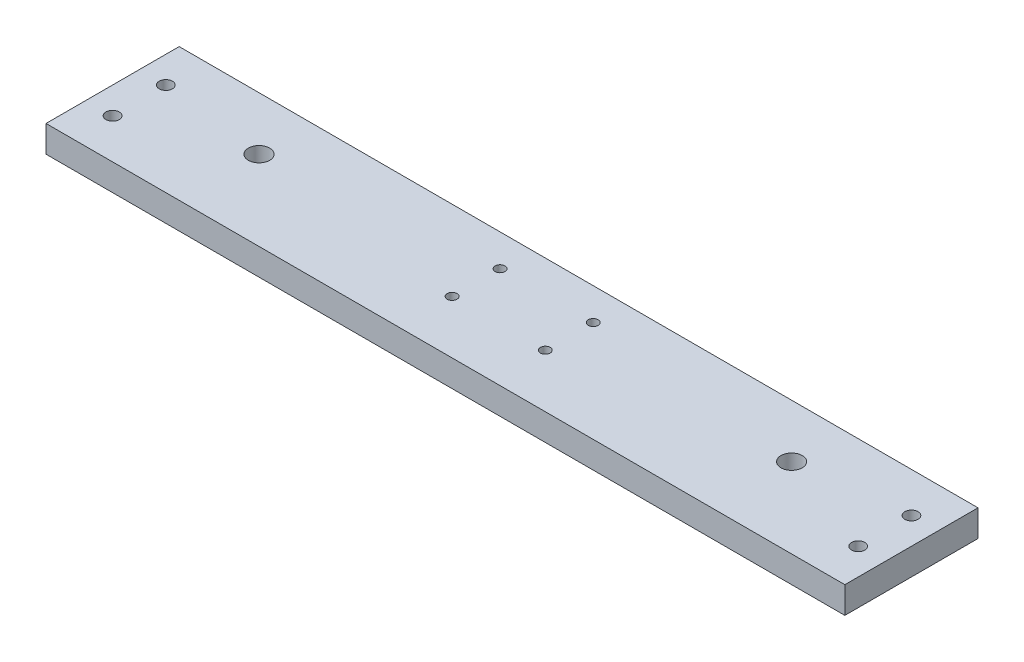
ISO-10303-21;
HEADER;
FILE_DESCRIPTION(('STEP AP214'),'2;1');
FILE_NAME('part.step','',(''),(''),'','','');
FILE_SCHEMA(('AUTOMOTIVE_DESIGN { 1 0 10303 214 1 1 1 1 }'));
ENDSEC;
DATA;
#1=APPLICATION_CONTEXT('core data for automotive mechanical design processes');
#2=APPLICATION_PROTOCOL_DEFINITION('international standard','automotive_design',2000,#1);
#3=PRODUCT_CONTEXT('',#1,'mechanical');
#4=PRODUCT('Part','Part','',(#3));
#5=PRODUCT_RELATED_PRODUCT_CATEGORY('part','',(#4));
#6=PRODUCT_DEFINITION_FORMATION('','',#4);
#7=PRODUCT_DEFINITION_CONTEXT('part definition',#1,'design');
#8=PRODUCT_DEFINITION('design','',#6,#7);
#9=PRODUCT_DEFINITION_SHAPE('','',#8);
#10=(LENGTH_UNIT() NAMED_UNIT(*) SI_UNIT(.MILLI.,.METRE.));
#11=(NAMED_UNIT(*) PLANE_ANGLE_UNIT() SI_UNIT($,.RADIAN.));
#12=(NAMED_UNIT(*) SI_UNIT($,.STERADIAN.) SOLID_ANGLE_UNIT());
#13=UNCERTAINTY_MEASURE_WITH_UNIT(LENGTH_MEASURE(1.E-05),#10,'distance_accuracy_value','');
#14=(GEOMETRIC_REPRESENTATION_CONTEXT(3) GLOBAL_UNCERTAINTY_ASSIGNED_CONTEXT((#13)) GLOBAL_UNIT_ASSIGNED_CONTEXT((#10,
#11,#12)) REPRESENTATION_CONTEXT('',''));
#15=CARTESIAN_POINT('',(0.,0.,0.));
#16=DIRECTION('',(0.,0.,1.));
#17=DIRECTION('',(1.,0.,0.));
#18=AXIS2_PLACEMENT_3D('',#15,#16,#17);
#19=CARTESIAN_POINT('',(0.,10.,0.));
#20=DIRECTION('',(0.,1.,0.));
#21=DIRECTION('',(0.,0.,1.));
#22=AXIS2_PLACEMENT_3D('',#19,#20,#21);
#23=PLANE('',#22);
#24=CARTESIAN_POINT('',(17.5,10.,-8.00000000000001));
#25=DIRECTION('',(0.,1.,0.));
#26=DIRECTION('',(0.,0.,-1.));
#27=AXIS2_PLACEMENT_3D('',#24,#25,#26);
#28=CIRCLE('',#27,1.85);
#29=CARTESIAN_POINT('',(17.5,10.,-9.85000000000001));
#30=VERTEX_POINT('',#29);
#31=EDGE_CURVE('E162',#30,#30,#28,.T.);
#32=ORIENTED_EDGE('',*,*,#31,.F.);
#33=EDGE_LOOP('',(#32));
#34=FACE_BOUND('',#33,.T.);
#35=CARTESIAN_POINT('',(-17.5,10.,10.));
#36=DIRECTION('',(0.,1.,0.));
#37=DIRECTION('',(0.,0.,-1.));
#38=AXIS2_PLACEMENT_3D('',#35,#36,#37);
#39=CIRCLE('',#38,1.85);
#40=CARTESIAN_POINT('',(-17.5,10.,8.15));
#41=VERTEX_POINT('',#40);
#42=EDGE_CURVE('E155',#41,#41,#39,.T.);
#43=ORIENTED_EDGE('',*,*,#42,.F.);
#44=EDGE_LOOP('',(#43));
#45=FACE_BOUND('',#44,.T.);
#46=CARTESIAN_POINT('',(17.5,10.,10.));
#47=DIRECTION('',(0.,1.,0.));
#48=DIRECTION('',(0.,0.,1.));
#49=AXIS2_PLACEMENT_3D('',#46,#47,#48);
#50=CIRCLE('',#49,1.85);
#51=CARTESIAN_POINT('',(17.5,10.,11.85));
#52=VERTEX_POINT('',#51);
#53=EDGE_CURVE('E167',#52,#52,#50,.T.);
#54=ORIENTED_EDGE('',*,*,#53,.F.);
#55=EDGE_LOOP('',(#54));
#56=FACE_BOUND('',#55,.T.);
#57=CARTESIAN_POINT('',(-17.5,10.,-8.));
#58=DIRECTION('',(0.,1.,0.));
#59=DIRECTION('',(0.,0.,1.));
#60=AXIS2_PLACEMENT_3D('',#57,#58,#59);
#61=CIRCLE('',#60,1.85);
#62=CARTESIAN_POINT('',(-17.5,10.,-6.15));
#63=VERTEX_POINT('',#62);
#64=EDGE_CURVE('E149',#63,#63,#61,.T.);
#65=ORIENTED_EDGE('',*,*,#64,.F.);
#66=EDGE_LOOP('',(#65));
#67=FACE_BOUND('',#66,.T.);
#68=CARTESIAN_POINT('',(140.,10.,-5.));
#69=DIRECTION('',(0.,1.,0.));
#70=DIRECTION('',(0.,0.,-1.));
#71=AXIS2_PLACEMENT_3D('',#68,#69,#70);
#72=CIRCLE('',#71,2.5);
#73=CARTESIAN_POINT('',(140.,10.,-7.49999999999999));
#74=VERTEX_POINT('',#73);
#75=EDGE_CURVE('E131',#74,#74,#72,.T.);
#76=ORIENTED_EDGE('',*,*,#75,.F.);
#77=EDGE_LOOP('',(#76));
#78=FACE_BOUND('',#77,.T.);
#79=CARTESIAN_POINT('',(140.,10.,15.));
#80=DIRECTION('',(0.,1.,0.));
#81=DIRECTION('',(0.,0.,1.));
#82=AXIS2_PLACEMENT_3D('',#79,#80,#81);
#83=CIRCLE('',#82,2.5);
#84=CARTESIAN_POINT('',(140.,10.,17.5));
#85=VERTEX_POINT('',#84);
#86=EDGE_CURVE('E138',#85,#85,#83,.T.);
#87=ORIENTED_EDGE('',*,*,#86,.F.);
#88=EDGE_LOOP('',(#87));
#89=FACE_BOUND('',#88,.T.);
#90=CARTESIAN_POINT('',(-140.,10.,15.));
#91=DIRECTION('',(0.,1.,0.));
#92=DIRECTION('',(0.,0.,-1.));
#93=AXIS2_PLACEMENT_3D('',#90,#91,#92);
#94=CIRCLE('',#93,2.5);
#95=CARTESIAN_POINT('',(-140.,10.,12.5));
#96=VERTEX_POINT('',#95);
#97=EDGE_CURVE('E144',#96,#96,#94,.T.);
#98=ORIENTED_EDGE('',*,*,#97,.F.);
#99=EDGE_LOOP('',(#98));
#100=FACE_BOUND('',#99,.T.);
#101=CARTESIAN_POINT('',(-140.,10.,-4.99999999999996));
#102=DIRECTION('',(0.,1.,0.));
#103=DIRECTION('',(0.,0.,1.));
#104=AXIS2_PLACEMENT_3D('',#101,#102,#103);
#105=CIRCLE('',#104,2.5);
#106=CARTESIAN_POINT('',(-140.,10.,-2.49999999999997));
#107=VERTEX_POINT('',#106);
#108=EDGE_CURVE('E125',#107,#107,#105,.T.);
#109=ORIENTED_EDGE('',*,*,#108,.F.);
#110=EDGE_LOOP('',(#109));
#111=FACE_BOUND('',#110,.T.);
#112=CARTESIAN_POINT('',(-100.,10.,0.));
#113=DIRECTION('',(0.,1.,0.));
#114=DIRECTION('',(0.,0.,1.));
#115=AXIS2_PLACEMENT_3D('',#112,#113,#114);
#116=CIRCLE('',#115,4.00000000000001);
#117=CARTESIAN_POINT('',(-100.,10.,4.00000000000002));
#118=VERTEX_POINT('',#117);
#119=EDGE_CURVE('E101',#118,#118,#116,.T.);
#120=ORIENTED_EDGE('',*,*,#119,.F.);
#121=EDGE_LOOP('',(#120));
#122=FACE_BOUND('',#121,.T.);
#123=DIRECTION('',(0.,0.,1.));
#124=VECTOR('',#123,1.);
#125=CARTESIAN_POINT('',(-150.,10.,30.));
#126=LINE('',#125,#124);
#127=CARTESIAN_POINT('',(-150.,10.,-20.));
#128=VERTEX_POINT('',#127);
#129=CARTESIAN_POINT('',(-150.,10.,30.));
#130=VERTEX_POINT('',#129);
#131=EDGE_CURVE('E86',#128,#130,#126,.T.);
#132=ORIENTED_EDGE('',*,*,#131,.T.);
#133=DIRECTION('',(1.,0.,0.));
#134=VECTOR('',#133,1.);
#135=CARTESIAN_POINT('',(150.,10.,30.));
#136=LINE('',#135,#134);
#137=CARTESIAN_POINT('',(150.,10.,30.));
#138=VERTEX_POINT('',#137);
#139=EDGE_CURVE('E81',#130,#138,#136,.T.);
#140=ORIENTED_EDGE('',*,*,#139,.T.);
#141=DIRECTION('',(0.,0.,-1.));
#142=VECTOR('',#141,1.);
#143=CARTESIAN_POINT('',(150.,10.,30.));
#144=LINE('',#143,#142);
#145=CARTESIAN_POINT('',(150.,10.,-20.));
#146=VERTEX_POINT('',#145);
#147=EDGE_CURVE('E84',#138,#146,#144,.T.);
#148=ORIENTED_EDGE('',*,*,#147,.T.);
#149=DIRECTION('',(-1.,0.,0.));
#150=VECTOR('',#149,1.);
#151=CARTESIAN_POINT('',(150.,10.,-20.));
#152=LINE('',#151,#150);
#153=EDGE_CURVE('E51',#146,#128,#152,.T.);
#154=ORIENTED_EDGE('',*,*,#153,.T.);
#155=EDGE_LOOP('',(#132,#140,#148,#154));
#156=FACE_BOUND('',#155,.T.);
#157=CARTESIAN_POINT('',(100.,10.,0.));
#158=DIRECTION('',(0.,1.,0.));
#159=DIRECTION('',(0.,0.,-1.));
#160=AXIS2_PLACEMENT_3D('',#157,#158,#159);
#161=CIRCLE('',#160,3.99999999999999);
#162=CARTESIAN_POINT('',(100.,10.,-4.));
#163=VERTEX_POINT('',#162);
#164=EDGE_CURVE('E116',#163,#163,#161,.T.);
#165=ORIENTED_EDGE('',*,*,#164,.F.);
#166=EDGE_LOOP('',(#165));
#167=FACE_BOUND('',#166,.T.);
#168=ADVANCED_FACE('F34',(#34,#45,#56,#67,#78,#89,#100,#111,#122,#156,#167),#23,.T.);
#169=CARTESIAN_POINT('',(0.,0.,0.));
#170=DIRECTION('',(0.,1.,0.));
#171=DIRECTION('',(0.,0.,1.));
#172=AXIS2_PLACEMENT_3D('',#169,#170,#171);
#173=PLANE('',#172);
#174=CARTESIAN_POINT('',(17.5,0.,-8.00000000000001));
#175=DIRECTION('',(0.,1.,0.));
#176=DIRECTION('',(0.,0.,-1.));
#177=AXIS2_PLACEMENT_3D('',#174,#175,#176);
#178=CIRCLE('',#177,1.85);
#179=CARTESIAN_POINT('',(17.5,0.,-9.85000000000001));
#180=VERTEX_POINT('',#179);
#181=EDGE_CURVE('E152',#180,#180,#178,.T.);
#182=ORIENTED_EDGE('',*,*,#181,.T.);
#183=EDGE_LOOP('',(#182));
#184=FACE_BOUND('',#183,.T.);
#185=CARTESIAN_POINT('',(-17.5,0.,10.));
#186=DIRECTION('',(0.,1.,0.));
#187=DIRECTION('',(0.,0.,-1.));
#188=AXIS2_PLACEMENT_3D('',#185,#186,#187);
#189=CIRCLE('',#188,1.85);
#190=CARTESIAN_POINT('',(-17.5,0.,8.15));
#191=VERTEX_POINT('',#190);
#192=EDGE_CURVE('E158',#191,#191,#189,.T.);
#193=ORIENTED_EDGE('',*,*,#192,.T.);
#194=EDGE_LOOP('',(#193));
#195=FACE_BOUND('',#194,.T.);
#196=CARTESIAN_POINT('',(17.5,0.,10.));
#197=DIRECTION('',(0.,1.,0.));
#198=DIRECTION('',(0.,0.,1.));
#199=AXIS2_PLACEMENT_3D('',#196,#197,#198);
#200=CIRCLE('',#199,1.85);
#201=CARTESIAN_POINT('',(17.5,0.,11.85));
#202=VERTEX_POINT('',#201);
#203=EDGE_CURVE('E159',#202,#202,#200,.T.);
#204=ORIENTED_EDGE('',*,*,#203,.T.);
#205=EDGE_LOOP('',(#204));
#206=FACE_BOUND('',#205,.T.);
#207=CARTESIAN_POINT('',(-17.5,0.,-8.));
#208=DIRECTION('',(0.,1.,0.));
#209=DIRECTION('',(0.,0.,1.));
#210=AXIS2_PLACEMENT_3D('',#207,#208,#209);
#211=CIRCLE('',#210,1.85);
#212=CARTESIAN_POINT('',(-17.5,0.,-6.15));
#213=VERTEX_POINT('',#212);
#214=EDGE_CURVE('E135',#213,#213,#211,.T.);
#215=ORIENTED_EDGE('',*,*,#214,.T.);
#216=EDGE_LOOP('',(#215));
#217=FACE_BOUND('',#216,.T.);
#218=CARTESIAN_POINT('',(140.,0.,-5.));
#219=DIRECTION('',(0.,1.,0.));
#220=DIRECTION('',(0.,0.,-1.));
#221=AXIS2_PLACEMENT_3D('',#218,#219,#220);
#222=CIRCLE('',#221,2.5);
#223=CARTESIAN_POINT('',(140.,0.,-7.49999999999999));
#224=VERTEX_POINT('',#223);
#225=EDGE_CURVE('E134',#224,#224,#222,.T.);
#226=ORIENTED_EDGE('',*,*,#225,.T.);
#227=EDGE_LOOP('',(#226));
#228=FACE_BOUND('',#227,.T.);
#229=CARTESIAN_POINT('',(140.,0.,15.));
#230=DIRECTION('',(0.,1.,0.));
#231=DIRECTION('',(0.,0.,1.));
#232=AXIS2_PLACEMENT_3D('',#229,#230,#231);
#233=CIRCLE('',#232,2.5);
#234=CARTESIAN_POINT('',(140.,0.,17.5));
#235=VERTEX_POINT('',#234);
#236=EDGE_CURVE('E141',#235,#235,#233,.T.);
#237=ORIENTED_EDGE('',*,*,#236,.T.);
#238=EDGE_LOOP('',(#237));
#239=FACE_BOUND('',#238,.T.);
#240=CARTESIAN_POINT('',(-140.,0.,15.));
#241=DIRECTION('',(0.,1.,0.));
#242=DIRECTION('',(0.,0.,-1.));
#243=AXIS2_PLACEMENT_3D('',#240,#241,#242);
#244=CIRCLE('',#243,2.5);
#245=CARTESIAN_POINT('',(-140.,0.,12.5));
#246=VERTEX_POINT('',#245);
#247=EDGE_CURVE('E128',#246,#246,#244,.T.);
#248=ORIENTED_EDGE('',*,*,#247,.T.);
#249=EDGE_LOOP('',(#248));
#250=FACE_BOUND('',#249,.T.);
#251=CARTESIAN_POINT('',(-140.,0.,-4.99999999999996));
#252=DIRECTION('',(0.,1.,0.));
#253=DIRECTION('',(0.,0.,1.));
#254=AXIS2_PLACEMENT_3D('',#251,#252,#253);
#255=CIRCLE('',#254,2.5);
#256=CARTESIAN_POINT('',(-140.,0.,-2.49999999999997));
#257=VERTEX_POINT('',#256);
#258=EDGE_CURVE('E122',#257,#257,#255,.T.);
#259=ORIENTED_EDGE('',*,*,#258,.T.);
#260=EDGE_LOOP('',(#259));
#261=FACE_BOUND('',#260,.T.);
#262=DIRECTION('',(0.,0.,1.));
#263=VECTOR('',#262,1.);
#264=CARTESIAN_POINT('',(-150.,0.,30.));
#265=LINE('',#264,#263);
#266=CARTESIAN_POINT('',(-150.,0.,-20.));
#267=VERTEX_POINT('',#266);
#268=CARTESIAN_POINT('',(-150.,0.,30.));
#269=VERTEX_POINT('',#268);
#270=EDGE_CURVE('E98',#267,#269,#265,.T.);
#271=ORIENTED_EDGE('',*,*,#270,.F.);
#272=DIRECTION('',(-1.,0.,0.));
#273=VECTOR('',#272,1.);
#274=CARTESIAN_POINT('',(150.,0.,-20.));
#275=LINE('',#274,#273);
#276=CARTESIAN_POINT('',(150.,0.,-20.));
#277=VERTEX_POINT('',#276);
#278=EDGE_CURVE('E74',#277,#267,#275,.T.);
#279=ORIENTED_EDGE('',*,*,#278,.F.);
#280=DIRECTION('',(0.,0.,-1.));
#281=VECTOR('',#280,1.);
#282=CARTESIAN_POINT('',(150.,0.,30.));
#283=LINE('',#282,#281);
#284=CARTESIAN_POINT('',(150.,0.,30.));
#285=VERTEX_POINT('',#284);
#286=EDGE_CURVE('E68',#285,#277,#283,.T.);
#287=ORIENTED_EDGE('',*,*,#286,.F.);
#288=DIRECTION('',(1.,0.,0.));
#289=VECTOR('',#288,1.);
#290=CARTESIAN_POINT('',(150.,0.,30.));
#291=LINE('',#290,#289);
#292=EDGE_CURVE('E90',#269,#285,#291,.T.);
#293=ORIENTED_EDGE('',*,*,#292,.F.);
#294=EDGE_LOOP('',(#271,#279,#287,#293));
#295=FACE_BOUND('',#294,.T.);
#296=CARTESIAN_POINT('',(-100.,0.,0.));
#297=DIRECTION('',(0.,1.,0.));
#298=DIRECTION('',(0.,0.,1.));
#299=AXIS2_PLACEMENT_3D('',#296,#297,#298);
#300=CIRCLE('',#299,4.00000000000001);
#301=CARTESIAN_POINT('',(-100.,0.,4.00000000000002));
#302=VERTEX_POINT('',#301);
#303=EDGE_CURVE('E113',#302,#302,#300,.T.);
#304=ORIENTED_EDGE('',*,*,#303,.T.);
#305=EDGE_LOOP('',(#304));
#306=FACE_BOUND('',#305,.T.);
#307=CARTESIAN_POINT('',(100.,0.,0.));
#308=DIRECTION('',(0.,1.,0.));
#309=DIRECTION('',(0.,0.,-1.));
#310=AXIS2_PLACEMENT_3D('',#307,#308,#309);
#311=CIRCLE('',#310,3.99999999999999);
#312=CARTESIAN_POINT('',(100.,0.,-4.));
#313=VERTEX_POINT('',#312);
#314=EDGE_CURVE('E119',#313,#313,#311,.T.);
#315=ORIENTED_EDGE('',*,*,#314,.T.);
#316=EDGE_LOOP('',(#315));
#317=FACE_BOUND('',#316,.T.);
#318=ADVANCED_FACE('F109',(#184,#195,#206,#217,#228,#239,#250,#261,#295,#306,#317),#173,.F.);
#319=CARTESIAN_POINT('',(-150.,10.,30.));
#320=DIRECTION('',(1.,0.,0.));
#321=DIRECTION('',(0.,0.,-1.));
#322=AXIS2_PLACEMENT_3D('',#319,#320,#321);
#323=PLANE('',#322);
#324=ORIENTED_EDGE('',*,*,#270,.T.);
#325=DIRECTION('',(0.,-1.,0.));
#326=VECTOR('',#325,1.);
#327=CARTESIAN_POINT('',(-150.,10.,30.));
#328=LINE('',#327,#326);
#329=EDGE_CURVE('E11',#130,#269,#328,.T.);
#330=ORIENTED_EDGE('',*,*,#329,.F.);
#331=ORIENTED_EDGE('',*,*,#131,.F.);
#332=DIRECTION('',(0.,-1.,0.));
#333=VECTOR('',#332,1.);
#334=CARTESIAN_POINT('',(-150.,10.,-20.));
#335=LINE('',#334,#333);
#336=EDGE_CURVE('E94',#128,#267,#335,.T.);
#337=ORIENTED_EDGE('',*,*,#336,.T.);
#338=EDGE_LOOP('',(#324,#330,#331,#337));
#339=FACE_BOUND('',#338,.T.);
#340=ADVANCED_FACE('F36',(#339),#323,.F.);
#341=CARTESIAN_POINT('',(150.,10.,30.));
#342=DIRECTION('',(0.,0.,-1.));
#343=DIRECTION('',(-1.,0.,0.));
#344=AXIS2_PLACEMENT_3D('',#341,#342,#343);
#345=PLANE('',#344);
#346=ORIENTED_EDGE('',*,*,#292,.T.);
#347=DIRECTION('',(0.,-1.,0.));
#348=VECTOR('',#347,1.);
#349=CARTESIAN_POINT('',(150.,10.,30.));
#350=LINE('',#349,#348);
#351=EDGE_CURVE('E43',#138,#285,#350,.T.);
#352=ORIENTED_EDGE('',*,*,#351,.F.);
#353=ORIENTED_EDGE('',*,*,#139,.F.);
#354=ORIENTED_EDGE('',*,*,#329,.T.);
#355=EDGE_LOOP('',(#346,#352,#353,#354));
#356=FACE_BOUND('',#355,.T.);
#357=ADVANCED_FACE('F89',(#356),#345,.F.);
#358=CARTESIAN_POINT('',(150.,10.,30.));
#359=DIRECTION('',(-1.,0.,0.));
#360=DIRECTION('',(0.,0.,1.));
#361=AXIS2_PLACEMENT_3D('',#358,#359,#360);
#362=PLANE('',#361);
#363=ORIENTED_EDGE('',*,*,#286,.T.);
#364=DIRECTION('',(0.,-1.,0.));
#365=VECTOR('',#364,1.);
#366=CARTESIAN_POINT('',(150.,10.,-20.));
#367=LINE('',#366,#365);
#368=EDGE_CURVE('E91',#146,#277,#367,.T.);
#369=ORIENTED_EDGE('',*,*,#368,.F.);
#370=ORIENTED_EDGE('',*,*,#147,.F.);
#371=ORIENTED_EDGE('',*,*,#351,.T.);
#372=EDGE_LOOP('',(#363,#369,#370,#371));
#373=FACE_BOUND('',#372,.T.);
#374=ADVANCED_FACE('F92',(#373),#362,.F.);
#375=CARTESIAN_POINT('',(150.,10.,-20.));
#376=DIRECTION('',(0.,0.,1.));
#377=DIRECTION('',(1.,0.,0.));
#378=AXIS2_PLACEMENT_3D('',#375,#376,#377);
#379=PLANE('',#378);
#380=ORIENTED_EDGE('',*,*,#278,.T.);
#381=ORIENTED_EDGE('',*,*,#336,.F.);
#382=ORIENTED_EDGE('',*,*,#153,.F.);
#383=ORIENTED_EDGE('',*,*,#368,.T.);
#384=EDGE_LOOP('',(#380,#381,#382,#383));
#385=FACE_BOUND('',#384,.T.);
#386=ADVANCED_FACE('F106',(#385),#379,.F.);
#387=CARTESIAN_POINT('',(-100.,10.,0.));
#388=DIRECTION('',(0.,-1.,0.));
#389=DIRECTION('',(0.,0.,-1.));
#390=AXIS2_PLACEMENT_3D('',#387,#388,#389);
#391=CYLINDRICAL_SURFACE('',#390,4.00000000000001);
#392=ORIENTED_EDGE('',*,*,#119,.T.);
#393=EDGE_LOOP('',(#392));
#394=FACE_BOUND('',#393,.T.);
#395=ORIENTED_EDGE('',*,*,#303,.F.);
#396=EDGE_LOOP('',(#395));
#397=FACE_BOUND('',#396,.T.);
#398=ADVANCED_FACE('F199',(#394,#397),#391,.F.);
#399=CARTESIAN_POINT('',(100.,10.,0.));
#400=DIRECTION('',(0.,-1.,0.));
#401=DIRECTION('',(0.,0.,-1.));
#402=AXIS2_PLACEMENT_3D('',#399,#400,#401);
#403=CYLINDRICAL_SURFACE('',#402,3.99999999999999);
#404=ORIENTED_EDGE('',*,*,#164,.T.);
#405=EDGE_LOOP('',(#404));
#406=FACE_BOUND('',#405,.T.);
#407=ORIENTED_EDGE('',*,*,#314,.F.);
#408=EDGE_LOOP('',(#407));
#409=FACE_BOUND('',#408,.T.);
#410=ADVANCED_FACE('F202',(#406,#409),#403,.F.);
#411=CARTESIAN_POINT('',(-140.,0.,-4.99999999999996));
#412=DIRECTION('',(0.,1.,0.));
#413=DIRECTION('',(0.,0.,1.));
#414=AXIS2_PLACEMENT_3D('',#411,#412,#413);
#415=CYLINDRICAL_SURFACE('',#414,2.5);
#416=ORIENTED_EDGE('',*,*,#258,.F.);
#417=EDGE_LOOP('',(#416));
#418=FACE_BOUND('',#417,.T.);
#419=ORIENTED_EDGE('',*,*,#108,.T.);
#420=EDGE_LOOP('',(#419));
#421=FACE_BOUND('',#420,.T.);
#422=ADVANCED_FACE('F212',(#418,#421),#415,.F.);
#423=CARTESIAN_POINT('',(-140.,0.,15.));
#424=DIRECTION('',(0.,1.,0.));
#425=DIRECTION('',(0.,0.,1.));
#426=AXIS2_PLACEMENT_3D('',#423,#424,#425);
#427=CYLINDRICAL_SURFACE('',#426,2.5);
#428=ORIENTED_EDGE('',*,*,#247,.F.);
#429=EDGE_LOOP('',(#428));
#430=FACE_BOUND('',#429,.T.);
#431=ORIENTED_EDGE('',*,*,#97,.T.);
#432=EDGE_LOOP('',(#431));
#433=FACE_BOUND('',#432,.T.);
#434=ADVANCED_FACE('F218',(#430,#433),#427,.F.);
#435=CARTESIAN_POINT('',(140.,0.,15.));
#436=DIRECTION('',(0.,1.,0.));
#437=DIRECTION('',(0.,0.,1.));
#438=AXIS2_PLACEMENT_3D('',#435,#436,#437);
#439=CYLINDRICAL_SURFACE('',#438,2.5);
#440=ORIENTED_EDGE('',*,*,#236,.F.);
#441=EDGE_LOOP('',(#440));
#442=FACE_BOUND('',#441,.T.);
#443=ORIENTED_EDGE('',*,*,#86,.T.);
#444=EDGE_LOOP('',(#443));
#445=FACE_BOUND('',#444,.T.);
#446=ADVANCED_FACE('F251',(#442,#445),#439,.F.);
#447=CARTESIAN_POINT('',(140.,0.,-5.));
#448=DIRECTION('',(0.,1.,0.));
#449=DIRECTION('',(0.,0.,1.));
#450=AXIS2_PLACEMENT_3D('',#447,#448,#449);
#451=CYLINDRICAL_SURFACE('',#450,2.5);
#452=ORIENTED_EDGE('',*,*,#225,.F.);
#453=EDGE_LOOP('',(#452));
#454=FACE_BOUND('',#453,.T.);
#455=ORIENTED_EDGE('',*,*,#75,.T.);
#456=EDGE_LOOP('',(#455));
#457=FACE_BOUND('',#456,.T.);
#458=ADVANCED_FACE('F246',(#454,#457),#451,.F.);
#459=CARTESIAN_POINT('',(-17.5,0.,-8.));
#460=DIRECTION('',(0.,1.,0.));
#461=DIRECTION('',(0.,0.,1.));
#462=AXIS2_PLACEMENT_3D('',#459,#460,#461);
#463=CYLINDRICAL_SURFACE('',#462,1.85);
#464=ORIENTED_EDGE('',*,*,#214,.F.);
#465=EDGE_LOOP('',(#464));
#466=FACE_BOUND('',#465,.T.);
#467=ORIENTED_EDGE('',*,*,#64,.T.);
#468=EDGE_LOOP('',(#467));
#469=FACE_BOUND('',#468,.T.);
#470=ADVANCED_FACE('F179',(#466,#469),#463,.F.);
#471=CARTESIAN_POINT('',(17.5,0.,10.));
#472=DIRECTION('',(0.,1.,0.));
#473=DIRECTION('',(0.,0.,1.));
#474=AXIS2_PLACEMENT_3D('',#471,#472,#473);
#475=CYLINDRICAL_SURFACE('',#474,1.85);
#476=ORIENTED_EDGE('',*,*,#203,.F.);
#477=EDGE_LOOP('',(#476));
#478=FACE_BOUND('',#477,.T.);
#479=ORIENTED_EDGE('',*,*,#53,.T.);
#480=EDGE_LOOP('',(#479));
#481=FACE_BOUND('',#480,.T.);
#482=ADVANCED_FACE('F175',(#478,#481),#475,.F.);
#483=CARTESIAN_POINT('',(-17.5,0.,10.));
#484=DIRECTION('',(0.,1.,0.));
#485=DIRECTION('',(0.,0.,1.));
#486=AXIS2_PLACEMENT_3D('',#483,#484,#485);
#487=CYLINDRICAL_SURFACE('',#486,1.85);
#488=ORIENTED_EDGE('',*,*,#192,.F.);
#489=EDGE_LOOP('',(#488));
#490=FACE_BOUND('',#489,.T.);
#491=ORIENTED_EDGE('',*,*,#42,.T.);
#492=EDGE_LOOP('',(#491));
#493=FACE_BOUND('',#492,.T.);
#494=ADVANCED_FACE('F178',(#490,#493),#487,.F.);
#495=CARTESIAN_POINT('',(17.5,0.,-8.00000000000001));
#496=DIRECTION('',(0.,1.,0.));
#497=DIRECTION('',(0.,0.,1.));
#498=AXIS2_PLACEMENT_3D('',#495,#496,#497);
#499=CYLINDRICAL_SURFACE('',#498,1.85);
#500=ORIENTED_EDGE('',*,*,#181,.F.);
#501=EDGE_LOOP('',(#500));
#502=FACE_BOUND('',#501,.T.);
#503=ORIENTED_EDGE('',*,*,#31,.T.);
#504=EDGE_LOOP('',(#503));
#505=FACE_BOUND('',#504,.T.);
#506=ADVANCED_FACE('F318',(#502,#505),#499,.F.);
#507=CLOSED_SHELL('',(#168,#318,#340,#357,#374,#386,#398,#410,#422,#434,#446,#458,#470,#482,
#494,#506));
#508=MANIFOLD_SOLID_BREP('B2',#507);
#509=ADVANCED_BREP_SHAPE_REPRESENTATION('',(#18,#508),#14);
#510=SHAPE_DEFINITION_REPRESENTATION(#9,#509);
ENDSEC;
END-ISO-10303-21;
